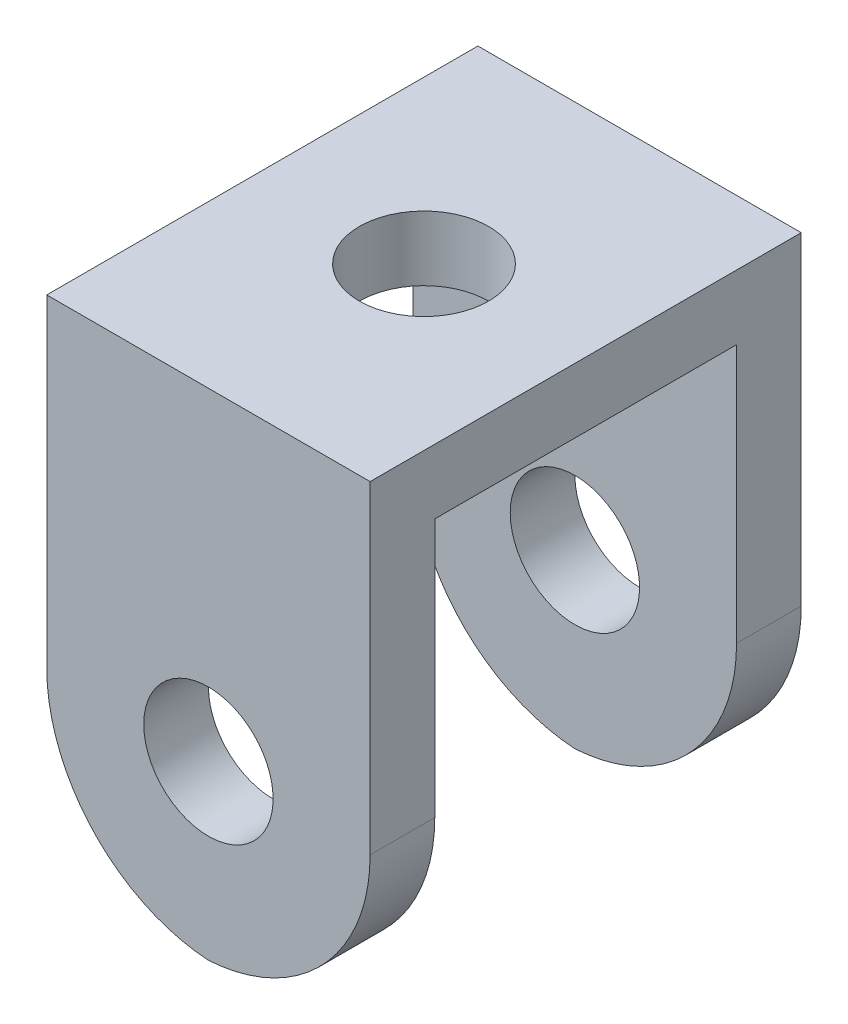
ISO-10303-21;
HEADER;
FILE_DESCRIPTION(('STEP AP214'),'2;1');
FILE_NAME('part.step','',(''),(''),'','','');
FILE_SCHEMA(('AUTOMOTIVE_DESIGN { 1 0 10303 214 1 1 1 1 }'));
ENDSEC;
DATA;
#1=APPLICATION_CONTEXT('core data for automotive mechanical design processes');
#2=APPLICATION_PROTOCOL_DEFINITION('international standard','automotive_design',2000,#1);
#3=PRODUCT_CONTEXT('',#1,'mechanical');
#4=PRODUCT('Part','Part','',(#3));
#5=PRODUCT_RELATED_PRODUCT_CATEGORY('part','',(#4));
#6=PRODUCT_DEFINITION_FORMATION('','',#4);
#7=PRODUCT_DEFINITION_CONTEXT('part definition',#1,'design');
#8=PRODUCT_DEFINITION('design','',#6,#7);
#9=PRODUCT_DEFINITION_SHAPE('','',#8);
#10=(LENGTH_UNIT() NAMED_UNIT(*) SI_UNIT(.MILLI.,.METRE.));
#11=(NAMED_UNIT(*) PLANE_ANGLE_UNIT() SI_UNIT($,.RADIAN.));
#12=(NAMED_UNIT(*) SI_UNIT($,.STERADIAN.) SOLID_ANGLE_UNIT());
#13=UNCERTAINTY_MEASURE_WITH_UNIT(LENGTH_MEASURE(1.E-05),#10,'distance_accuracy_value','');
#14=(GEOMETRIC_REPRESENTATION_CONTEXT(3) GLOBAL_UNCERTAINTY_ASSIGNED_CONTEXT((#13)) GLOBAL_UNIT_ASSIGNED_CONTEXT((#10,
#11,#12)) REPRESENTATION_CONTEXT('',''));
#15=CARTESIAN_POINT('',(0.,0.,0.));
#16=DIRECTION('',(0.,0.,1.));
#17=DIRECTION('',(1.,0.,0.));
#18=AXIS2_PLACEMENT_3D('',#15,#16,#17);
#19=CARTESIAN_POINT('',(0.,0.,0.));
#20=DIRECTION('',(0.,1.,0.));
#21=DIRECTION('',(0.,0.,1.));
#22=AXIS2_PLACEMENT_3D('',#19,#20,#21);
#23=PLANE('',#22);
#24=CARTESIAN_POINT('',(0.,0.,0.));
#25=DIRECTION('',(0.,1.,0.));
#26=DIRECTION('',(0.,0.,1.));
#27=AXIS2_PLACEMENT_3D('',#24,#25,#26);
#28=CIRCLE('',#27,3.);
#29=CARTESIAN_POINT('',(0.,0.,3.));
#30=VERTEX_POINT('',#29);
#31=EDGE_CURVE('E217',#30,#30,#28,.T.);
#32=ORIENTED_EDGE('',*,*,#31,.T.);
#33=EDGE_LOOP('',(#32));
#34=FACE_BOUND('',#33,.T.);
#35=DIRECTION('',(1.,0.,0.));
#36=VECTOR('',#35,1.);
#37=CARTESIAN_POINT('',(7.5,0.,7.));
#38=LINE('',#37,#36);
#39=CARTESIAN_POINT('',(-7.5,0.,7.));
#40=VERTEX_POINT('',#39);
#41=CARTESIAN_POINT('',(7.5,0.,7.));
#42=VERTEX_POINT('',#41);
#43=EDGE_CURVE('E122',#40,#42,#38,.T.);
#44=ORIENTED_EDGE('',*,*,#43,.F.);
#45=DIRECTION('',(0.,0.,1.));
#46=VECTOR('',#45,1.);
#47=CARTESIAN_POINT('',(-7.5,0.,-10.));
#48=LINE('',#47,#46);
#49=CARTESIAN_POINT('',(-7.5,0.,-7.));
#50=VERTEX_POINT('',#49);
#51=EDGE_CURVE('E137',#50,#40,#48,.T.);
#52=ORIENTED_EDGE('',*,*,#51,.F.);
#53=DIRECTION('',(-1.,0.,0.));
#54=VECTOR('',#53,1.);
#55=CARTESIAN_POINT('',(7.5,0.,-7.));
#56=LINE('',#55,#54);
#57=CARTESIAN_POINT('',(7.5,0.,-7.));
#58=VERTEX_POINT('',#57);
#59=EDGE_CURVE('E131',#58,#50,#56,.T.);
#60=ORIENTED_EDGE('',*,*,#59,.F.);
#61=DIRECTION('',(0.,0.,-1.));
#62=VECTOR('',#61,1.);
#63=CARTESIAN_POINT('',(7.5,0.,-10.));
#64=LINE('',#63,#62);
#65=EDGE_CURVE('E140',#42,#58,#64,.T.);
#66=ORIENTED_EDGE('',*,*,#65,.F.);
#67=EDGE_LOOP('',(#44,#52,#60,#66));
#68=FACE_BOUND('',#67,.T.);
#69=ADVANCED_FACE('F39',(#34,#68),#23,.F.);
#70=CARTESIAN_POINT('',(-7.5,3.,-10.));
#71=DIRECTION('',(1.,0.,0.));
#72=DIRECTION('',(0.,0.,-1.));
#73=AXIS2_PLACEMENT_3D('',#70,#71,#72);
#74=PLANE('',#73);
#75=DIRECTION('',(0.,1.,0.));
#76=VECTOR('',#75,1.);
#77=CARTESIAN_POINT('',(-7.5,-20.,7.));
#78=LINE('',#77,#76);
#79=CARTESIAN_POINT('',(-7.5,-12.,7.));
#80=VERTEX_POINT('',#79);
#81=EDGE_CURVE('E118',#80,#40,#78,.T.);
#82=ORIENTED_EDGE('',*,*,#81,.F.);
#83=DIRECTION('',(0.,0.,-1.));
#84=VECTOR('',#83,1.);
#85=CARTESIAN_POINT('',(-7.5,-12.,-10.));
#86=LINE('',#85,#84);
#87=CARTESIAN_POINT('',(-7.5,-12.,10.));
#88=VERTEX_POINT('',#87);
#89=EDGE_CURVE('E186',#80,#88,#86,.F.);
#90=ORIENTED_EDGE('',*,*,#89,.T.);
#91=DIRECTION('',(0.,-1.,0.));
#92=VECTOR('',#91,1.);
#93=CARTESIAN_POINT('',(-7.5,3.,10.));
#94=LINE('',#93,#92);
#95=CARTESIAN_POINT('',(-7.5,3.,10.));
#96=VERTEX_POINT('',#95);
#97=EDGE_CURVE('E169',#96,#88,#94,.T.);
#98=ORIENTED_EDGE('',*,*,#97,.F.);
#99=DIRECTION('',(0.,0.,1.));
#100=VECTOR('',#99,1.);
#101=CARTESIAN_POINT('',(-7.5,3.,-10.));
#102=LINE('',#101,#100);
#103=CARTESIAN_POINT('',(-7.5,3.,-10.));
#104=VERTEX_POINT('',#103);
#105=EDGE_CURVE('E151',#104,#96,#102,.T.);
#106=ORIENTED_EDGE('',*,*,#105,.F.);
#107=DIRECTION('',(0.,-1.,0.));
#108=VECTOR('',#107,1.);
#109=CARTESIAN_POINT('',(-7.5,3.,-10.));
#110=LINE('',#109,#108);
#111=CARTESIAN_POINT('',(-7.5,-12.,-10.));
#112=VERTEX_POINT('',#111);
#113=EDGE_CURVE('E158',#104,#112,#110,.T.);
#114=ORIENTED_EDGE('',*,*,#113,.T.);
#115=DIRECTION('',(0.,0.,-1.));
#116=VECTOR('',#115,1.);
#117=CARTESIAN_POINT('',(-7.5,-12.,-7.));
#118=LINE('',#117,#116);
#119=CARTESIAN_POINT('',(-7.5,-12.,-7.));
#120=VERTEX_POINT('',#119);
#121=EDGE_CURVE('E183',#112,#120,#118,.F.);
#122=ORIENTED_EDGE('',*,*,#121,.T.);
#123=DIRECTION('',(0.,1.,0.));
#124=VECTOR('',#123,1.);
#125=CARTESIAN_POINT('',(-7.5,-20.,-7.));
#126=LINE('',#125,#124);
#127=EDGE_CURVE('E145',#120,#50,#126,.T.);
#128=ORIENTED_EDGE('',*,*,#127,.T.);
#129=ORIENTED_EDGE('',*,*,#51,.T.);
#130=EDGE_LOOP('',(#82,#90,#98,#106,#114,#122,#128,#129));
#131=FACE_BOUND('',#130,.T.);
#132=ADVANCED_FACE('F144',(#131),#74,.F.);
#133=CARTESIAN_POINT('',(-7.5,3.,10.));
#134=DIRECTION('',(0.,0.,-1.));
#135=DIRECTION('',(-1.,0.,0.));
#136=AXIS2_PLACEMENT_3D('',#133,#134,#135);
#137=PLANE('',#136);
#138=CARTESIAN_POINT('',(0.,-12.,10.));
#139=DIRECTION('',(0.,0.,-1.));
#140=DIRECTION('',(-1.,0.,0.));
#141=AXIS2_PLACEMENT_3D('',#138,#139,#140);
#142=CIRCLE('',#141,3.);
#143=CARTESIAN_POINT('',(-3.,-12.,10.));
#144=VERTEX_POINT('',#143);
#145=EDGE_CURVE('E178',#144,#144,#142,.T.);
#146=ORIENTED_EDGE('',*,*,#145,.T.);
#147=EDGE_LOOP('',(#146));
#148=FACE_BOUND('',#147,.T.);
#149=ORIENTED_EDGE('',*,*,#97,.T.);
#150=CARTESIAN_POINT('',(0.5,-12.,10.));
#151=DIRECTION('',(0.,0.,-1.));
#152=DIRECTION('',(-1.,0.,0.));
#153=AXIS2_PLACEMENT_3D('',#150,#151,#152);
#154=CIRCLE('',#153,8.);
#155=CARTESIAN_POINT('',(0.,-19.9843597113357,10.));
#156=VERTEX_POINT('',#155);
#157=EDGE_CURVE('E192',#88,#156,#154,.F.);
#158=ORIENTED_EDGE('',*,*,#157,.T.);
#159=CARTESIAN_POINT('',(-0.5,-12.,10.));
#160=DIRECTION('',(0.,0.,-1.));
#161=DIRECTION('',(-1.,0.,0.));
#162=AXIS2_PLACEMENT_3D('',#159,#160,#161);
#163=CIRCLE('',#162,8.);
#164=CARTESIAN_POINT('',(7.5,-12.,10.));
#165=VERTEX_POINT('',#164);
#166=EDGE_CURVE('E189',#156,#165,#163,.F.);
#167=ORIENTED_EDGE('',*,*,#166,.T.);
#168=DIRECTION('',(0.,-1.,0.));
#169=VECTOR('',#168,1.);
#170=CARTESIAN_POINT('',(7.5,3.,10.));
#171=LINE('',#170,#169);
#172=CARTESIAN_POINT('',(7.5,3.,10.));
#173=VERTEX_POINT('',#172);
#174=EDGE_CURVE('E165',#173,#165,#171,.T.);
#175=ORIENTED_EDGE('',*,*,#174,.F.);
#176=DIRECTION('',(1.,0.,0.));
#177=VECTOR('',#176,1.);
#178=CARTESIAN_POINT('',(-7.5,3.,10.));
#179=LINE('',#178,#177);
#180=EDGE_CURVE('E234',#96,#173,#179,.T.);
#181=ORIENTED_EDGE('',*,*,#180,.F.);
#182=EDGE_LOOP('',(#149,#158,#167,#175,#181));
#183=FACE_BOUND('',#182,.T.);
#184=ADVANCED_FACE('F291',(#148,#183),#137,.F.);
#185=CARTESIAN_POINT('',(7.5,3.,-10.));
#186=DIRECTION('',(-1.,0.,0.));
#187=DIRECTION('',(0.,0.,1.));
#188=AXIS2_PLACEMENT_3D('',#185,#186,#187);
#189=PLANE('',#188);
#190=ORIENTED_EDGE('',*,*,#174,.T.);
#191=DIRECTION('',(0.,0.,1.));
#192=VECTOR('',#191,1.);
#193=CARTESIAN_POINT('',(7.5,-12.,-10.));
#194=LINE('',#193,#192);
#195=CARTESIAN_POINT('',(7.5,-12.,7.));
#196=VERTEX_POINT('',#195);
#197=EDGE_CURVE('E199',#165,#196,#194,.F.);
#198=ORIENTED_EDGE('',*,*,#197,.T.);
#199=DIRECTION('',(0.,1.,0.));
#200=VECTOR('',#199,1.);
#201=CARTESIAN_POINT('',(7.5,-20.,7.));
#202=LINE('',#201,#200);
#203=EDGE_CURVE('E132',#196,#42,#202,.T.);
#204=ORIENTED_EDGE('',*,*,#203,.T.);
#205=ORIENTED_EDGE('',*,*,#65,.T.);
#206=DIRECTION('',(0.,1.,0.));
#207=VECTOR('',#206,1.);
#208=CARTESIAN_POINT('',(7.5,-20.,-7.));
#209=LINE('',#208,#207);
#210=CARTESIAN_POINT('',(7.5,-12.,-7.));
#211=VERTEX_POINT('',#210);
#212=EDGE_CURVE('E147',#211,#58,#209,.T.);
#213=ORIENTED_EDGE('',*,*,#212,.F.);
#214=DIRECTION('',(0.,0.,1.));
#215=VECTOR('',#214,1.);
#216=CARTESIAN_POINT('',(7.5,-12.,-10.));
#217=LINE('',#216,#215);
#218=CARTESIAN_POINT('',(7.5,-12.,-10.));
#219=VERTEX_POINT('',#218);
#220=EDGE_CURVE('E195',#211,#219,#217,.F.);
#221=ORIENTED_EDGE('',*,*,#220,.T.);
#222=DIRECTION('',(0.,-1.,0.));
#223=VECTOR('',#222,1.);
#224=CARTESIAN_POINT('',(7.5,3.,-10.));
#225=LINE('',#224,#223);
#226=CARTESIAN_POINT('',(7.5,3.,-10.));
#227=VERTEX_POINT('',#226);
#228=EDGE_CURVE('E162',#227,#219,#225,.T.);
#229=ORIENTED_EDGE('',*,*,#228,.F.);
#230=DIRECTION('',(0.,0.,-1.));
#231=VECTOR('',#230,1.);
#232=CARTESIAN_POINT('',(7.5,3.,-10.));
#233=LINE('',#232,#231);
#234=EDGE_CURVE('E237',#173,#227,#233,.T.);
#235=ORIENTED_EDGE('',*,*,#234,.F.);
#236=EDGE_LOOP('',(#190,#198,#204,#205,#213,#221,#229,#235));
#237=FACE_BOUND('',#236,.T.);
#238=ADVANCED_FACE('F246',(#237),#189,.F.);
#239=CARTESIAN_POINT('',(-7.5,3.,-10.));
#240=DIRECTION('',(0.,0.,1.));
#241=DIRECTION('',(1.,0.,0.));
#242=AXIS2_PLACEMENT_3D('',#239,#240,#241);
#243=PLANE('',#242);
#244=CARTESIAN_POINT('',(0.,-12.,-10.));
#245=DIRECTION('',(0.,0.,-1.));
#246=DIRECTION('',(-1.,0.,0.));
#247=AXIS2_PLACEMENT_3D('',#244,#245,#246);
#248=CIRCLE('',#247,3.);
#249=CARTESIAN_POINT('',(-3.,-12.,-10.));
#250=VERTEX_POINT('',#249);
#251=EDGE_CURVE('E258',#250,#250,#248,.T.);
#252=ORIENTED_EDGE('',*,*,#251,.F.);
#253=EDGE_LOOP('',(#252));
#254=FACE_BOUND('',#253,.T.);
#255=ORIENTED_EDGE('',*,*,#228,.T.);
#256=CARTESIAN_POINT('',(-0.499999999999999,-12.,-10.));
#257=DIRECTION('',(0.,0.,1.));
#258=DIRECTION('',(1.,0.,0.));
#259=AXIS2_PLACEMENT_3D('',#256,#257,#258);
#260=CIRCLE('',#259,8.);
#261=CARTESIAN_POINT('',(0.,-19.9843597113357,-10.));
#262=VERTEX_POINT('',#261);
#263=EDGE_CURVE('E11',#219,#262,#260,.F.);
#264=ORIENTED_EDGE('',*,*,#263,.T.);
#265=CARTESIAN_POINT('',(0.500000000000002,-12.,-10.));
#266=DIRECTION('',(0.,0.,1.));
#267=DIRECTION('',(1.,0.,0.));
#268=AXIS2_PLACEMENT_3D('',#265,#266,#267);
#269=CIRCLE('',#268,8.);
#270=EDGE_CURVE('E49',#262,#112,#269,.F.);
#271=ORIENTED_EDGE('',*,*,#270,.T.);
#272=ORIENTED_EDGE('',*,*,#113,.F.);
#273=DIRECTION('',(-1.,0.,0.));
#274=VECTOR('',#273,1.);
#275=CARTESIAN_POINT('',(-7.5,3.,-10.));
#276=LINE('',#275,#274);
#277=EDGE_CURVE('E155',#227,#104,#276,.T.);
#278=ORIENTED_EDGE('',*,*,#277,.F.);
#279=EDGE_LOOP('',(#255,#264,#271,#272,#278));
#280=FACE_BOUND('',#279,.T.);
#281=ADVANCED_FACE('F227',(#254,#280),#243,.F.);
#282=CARTESIAN_POINT('',(0.,3.,0.));
#283=DIRECTION('',(0.,1.,0.));
#284=DIRECTION('',(0.,0.,1.));
#285=AXIS2_PLACEMENT_3D('',#282,#283,#284);
#286=PLANE('',#285);
#287=CARTESIAN_POINT('',(0.,3.,0.));
#288=DIRECTION('',(0.,1.,0.));
#289=DIRECTION('',(0.,0.,1.));
#290=AXIS2_PLACEMENT_3D('',#287,#288,#289);
#291=CIRCLE('',#290,3.);
#292=CARTESIAN_POINT('',(0.,3.,3.));
#293=VERTEX_POINT('',#292);
#294=EDGE_CURVE('E211',#293,#293,#291,.T.);
#295=ORIENTED_EDGE('',*,*,#294,.F.);
#296=EDGE_LOOP('',(#295));
#297=FACE_BOUND('',#296,.T.);
#298=ORIENTED_EDGE('',*,*,#105,.T.);
#299=ORIENTED_EDGE('',*,*,#180,.T.);
#300=ORIENTED_EDGE('',*,*,#234,.T.);
#301=ORIENTED_EDGE('',*,*,#277,.T.);
#302=EDGE_LOOP('',(#298,#299,#300,#301));
#303=FACE_BOUND('',#302,.T.);
#304=ADVANCED_FACE('F244',(#297,#303),#286,.T.);
#305=CARTESIAN_POINT('',(7.5,-20.,-7.));
#306=DIRECTION('',(0.,0.,-1.));
#307=DIRECTION('',(-1.,0.,0.));
#308=AXIS2_PLACEMENT_3D('',#305,#306,#307);
#309=PLANE('',#308);
#310=CARTESIAN_POINT('',(0.,-12.,-7.));
#311=DIRECTION('',(0.,0.,-1.));
#312=DIRECTION('',(-1.,0.,0.));
#313=AXIS2_PLACEMENT_3D('',#310,#311,#312);
#314=CIRCLE('',#313,3.);
#315=CARTESIAN_POINT('',(-3.,-12.,-7.));
#316=VERTEX_POINT('',#315);
#317=EDGE_CURVE('E142',#316,#316,#314,.T.);
#318=ORIENTED_EDGE('',*,*,#317,.T.);
#319=EDGE_LOOP('',(#318));
#320=FACE_BOUND('',#319,.T.);
#321=CARTESIAN_POINT('',(0.500000000000002,-12.,-7.));
#322=DIRECTION('',(0.,0.,-1.));
#323=DIRECTION('',(-1.,0.,0.));
#324=AXIS2_PLACEMENT_3D('',#321,#322,#323);
#325=CIRCLE('',#324,8.);
#326=CARTESIAN_POINT('',(0.,-19.9843597113357,-7.));
#327=VERTEX_POINT('',#326);
#328=EDGE_CURVE('E63',#120,#327,#325,.F.);
#329=ORIENTED_EDGE('',*,*,#328,.T.);
#330=CARTESIAN_POINT('',(-0.499999999999999,-12.,-7.));
#331=DIRECTION('',(0.,0.,-1.));
#332=DIRECTION('',(-1.,0.,0.));
#333=AXIS2_PLACEMENT_3D('',#330,#331,#332);
#334=CIRCLE('',#333,8.);
#335=EDGE_CURVE('E204',#327,#211,#334,.F.);
#336=ORIENTED_EDGE('',*,*,#335,.T.);
#337=ORIENTED_EDGE('',*,*,#212,.T.);
#338=ORIENTED_EDGE('',*,*,#59,.T.);
#339=ORIENTED_EDGE('',*,*,#127,.F.);
#340=EDGE_LOOP('',(#329,#336,#337,#338,#339));
#341=FACE_BOUND('',#340,.T.);
#342=ADVANCED_FACE('F248',(#320,#341),#309,.F.);
#343=CARTESIAN_POINT('',(7.5,-20.,7.));
#344=DIRECTION('',(0.,0.,1.));
#345=DIRECTION('',(1.,0.,0.));
#346=AXIS2_PLACEMENT_3D('',#343,#344,#345);
#347=PLANE('',#346);
#348=CARTESIAN_POINT('',(0.,-12.,7.));
#349=DIRECTION('',(0.,0.,1.));
#350=DIRECTION('',(1.,0.,0.));
#351=AXIS2_PLACEMENT_3D('',#348,#349,#350);
#352=CIRCLE('',#351,3.);
#353=CARTESIAN_POINT('',(3.,-12.,7.));
#354=VERTEX_POINT('',#353);
#355=EDGE_CURVE('E174',#354,#354,#352,.T.);
#356=ORIENTED_EDGE('',*,*,#355,.T.);
#357=EDGE_LOOP('',(#356));
#358=FACE_BOUND('',#357,.T.);
#359=CARTESIAN_POINT('',(-0.5,-12.,7.));
#360=DIRECTION('',(0.,0.,1.));
#361=DIRECTION('',(1.,0.,0.));
#362=AXIS2_PLACEMENT_3D('',#359,#360,#361);
#363=CIRCLE('',#362,8.);
#364=CARTESIAN_POINT('',(0.,-19.9843597113357,7.));
#365=VERTEX_POINT('',#364);
#366=EDGE_CURVE('E173',#196,#365,#363,.F.);
#367=ORIENTED_EDGE('',*,*,#366,.T.);
#368=CARTESIAN_POINT('',(0.500000000000001,-12.,7.));
#369=DIRECTION('',(0.,0.,1.));
#370=DIRECTION('',(1.,0.,0.));
#371=AXIS2_PLACEMENT_3D('',#368,#369,#370);
#372=CIRCLE('',#371,8.);
#373=EDGE_CURVE('E125',#365,#80,#372,.F.);
#374=ORIENTED_EDGE('',*,*,#373,.T.);
#375=ORIENTED_EDGE('',*,*,#81,.T.);
#376=ORIENTED_EDGE('',*,*,#43,.T.);
#377=ORIENTED_EDGE('',*,*,#203,.F.);
#378=EDGE_LOOP('',(#367,#374,#375,#376,#377));
#379=FACE_BOUND('',#378,.T.);
#380=ADVANCED_FACE('F120',(#358,#379),#347,.F.);
#381=CARTESIAN_POINT('',(0.,-12.,10.));
#382=DIRECTION('',(0.,0.,-1.));
#383=DIRECTION('',(-1.,0.,0.));
#384=AXIS2_PLACEMENT_3D('',#381,#382,#383);
#385=CYLINDRICAL_SURFACE('',#384,3.);
#386=ORIENTED_EDGE('',*,*,#145,.F.);
#387=EDGE_LOOP('',(#386));
#388=FACE_BOUND('',#387,.T.);
#389=ORIENTED_EDGE('',*,*,#355,.F.);
#390=EDGE_LOOP('',(#389));
#391=FACE_BOUND('',#390,.T.);
#392=ADVANCED_FACE('F283',(#388,#391),#385,.F.);
#393=ORIENTED_EDGE('',*,*,#251,.T.);
#394=EDGE_LOOP('',(#393));
#395=FACE_BOUND('',#394,.T.);
#396=ORIENTED_EDGE('',*,*,#317,.F.);
#397=EDGE_LOOP('',(#396));
#398=FACE_BOUND('',#397,.T.);
#399=ADVANCED_FACE('F273',(#395,#398),#385,.F.);
#400=CARTESIAN_POINT('',(0.,-12.,0.));
#401=DIRECTION('',(0.,1.,0.));
#402=DIRECTION('',(0.,0.,1.));
#403=AXIS2_PLACEMENT_3D('',#400,#401,#402);
#404=CYLINDRICAL_SURFACE('',#403,3.);
#405=ORIENTED_EDGE('',*,*,#294,.T.);
#406=EDGE_LOOP('',(#405));
#407=FACE_BOUND('',#406,.T.);
#408=ORIENTED_EDGE('',*,*,#31,.F.);
#409=EDGE_LOOP('',(#408));
#410=FACE_BOUND('',#409,.T.);
#411=ADVANCED_FACE('F270',(#407,#410),#404,.F.);
#412=CARTESIAN_POINT('',(-0.5,-12.,0.));
#413=DIRECTION('',(0.,0.,1.));
#414=DIRECTION('',(1.,0.,0.));
#415=AXIS2_PLACEMENT_3D('',#412,#413,#414);
#416=CYLINDRICAL_SURFACE('',#415,8.);
#417=ORIENTED_EDGE('',*,*,#197,.F.);
#418=ORIENTED_EDGE('',*,*,#166,.F.);
#419=DIRECTION('',(0.,0.,1.));
#420=VECTOR('',#419,1.);
#421=CARTESIAN_POINT('',(0.,-19.9843597113357,8.5));
#422=LINE('',#421,#420);
#423=EDGE_CURVE('E208',#365,#156,#422,.T.);
#424=ORIENTED_EDGE('',*,*,#423,.F.);
#425=ORIENTED_EDGE('',*,*,#366,.F.);
#426=EDGE_LOOP('',(#417,#418,#424,#425));
#427=FACE_BOUND('',#426,.T.);
#428=ADVANCED_FACE('F272',(#427),#416,.T.);
#429=CARTESIAN_POINT('',(0.500000000000001,-12.,0.));
#430=DIRECTION('',(0.,0.,-1.));
#431=DIRECTION('',(-1.,0.,0.));
#432=AXIS2_PLACEMENT_3D('',#429,#430,#431);
#433=CYLINDRICAL_SURFACE('',#432,8.);
#434=ORIENTED_EDGE('',*,*,#157,.F.);
#435=ORIENTED_EDGE('',*,*,#89,.F.);
#436=ORIENTED_EDGE('',*,*,#373,.F.);
#437=ORIENTED_EDGE('',*,*,#423,.T.);
#438=EDGE_LOOP('',(#434,#435,#436,#437));
#439=FACE_BOUND('',#438,.T.);
#440=ADVANCED_FACE('F280',(#439),#433,.T.);
#441=CARTESIAN_POINT('',(0.500000000000001,-12.,0.));
#442=DIRECTION('',(0.,0.,1.));
#443=DIRECTION('',(1.,0.,0.));
#444=AXIS2_PLACEMENT_3D('',#441,#442,#443);
#445=CYLINDRICAL_SURFACE('',#444,8.);
#446=ORIENTED_EDGE('',*,*,#121,.F.);
#447=ORIENTED_EDGE('',*,*,#270,.F.);
#448=DIRECTION('',(0.,0.,1.));
#449=VECTOR('',#448,1.);
#450=CARTESIAN_POINT('',(0.,-19.9843597113357,-8.5));
#451=LINE('',#450,#449);
#452=EDGE_CURVE('E43',#327,#262,#451,.F.);
#453=ORIENTED_EDGE('',*,*,#452,.F.);
#454=ORIENTED_EDGE('',*,*,#328,.F.);
#455=EDGE_LOOP('',(#446,#447,#453,#454));
#456=FACE_BOUND('',#455,.T.);
#457=ADVANCED_FACE('F41',(#456),#445,.T.);
#458=CARTESIAN_POINT('',(-0.5,-12.,0.));
#459=DIRECTION('',(0.,0.,-1.));
#460=DIRECTION('',(-1.,0.,0.));
#461=AXIS2_PLACEMENT_3D('',#458,#459,#460);
#462=CYLINDRICAL_SURFACE('',#461,8.);
#463=ORIENTED_EDGE('',*,*,#263,.F.);
#464=ORIENTED_EDGE('',*,*,#220,.F.);
#465=ORIENTED_EDGE('',*,*,#335,.F.);
#466=ORIENTED_EDGE('',*,*,#452,.T.);
#467=EDGE_LOOP('',(#463,#464,#465,#466));
#468=FACE_BOUND('',#467,.T.);
#469=ADVANCED_FACE('F222',(#468),#462,.T.);
#470=CLOSED_SHELL('',(#69,#132,#184,#238,#281,#304,#342,#380,#392,#399,#411,#428,#440,#457,#469));
#471=MANIFOLD_SOLID_BREP('B2',#470);
#472=ADVANCED_BREP_SHAPE_REPRESENTATION('',(#18,#471),#14);
#473=SHAPE_DEFINITION_REPRESENTATION(#9,#472);
ENDSEC;
END-ISO-10303-21;
